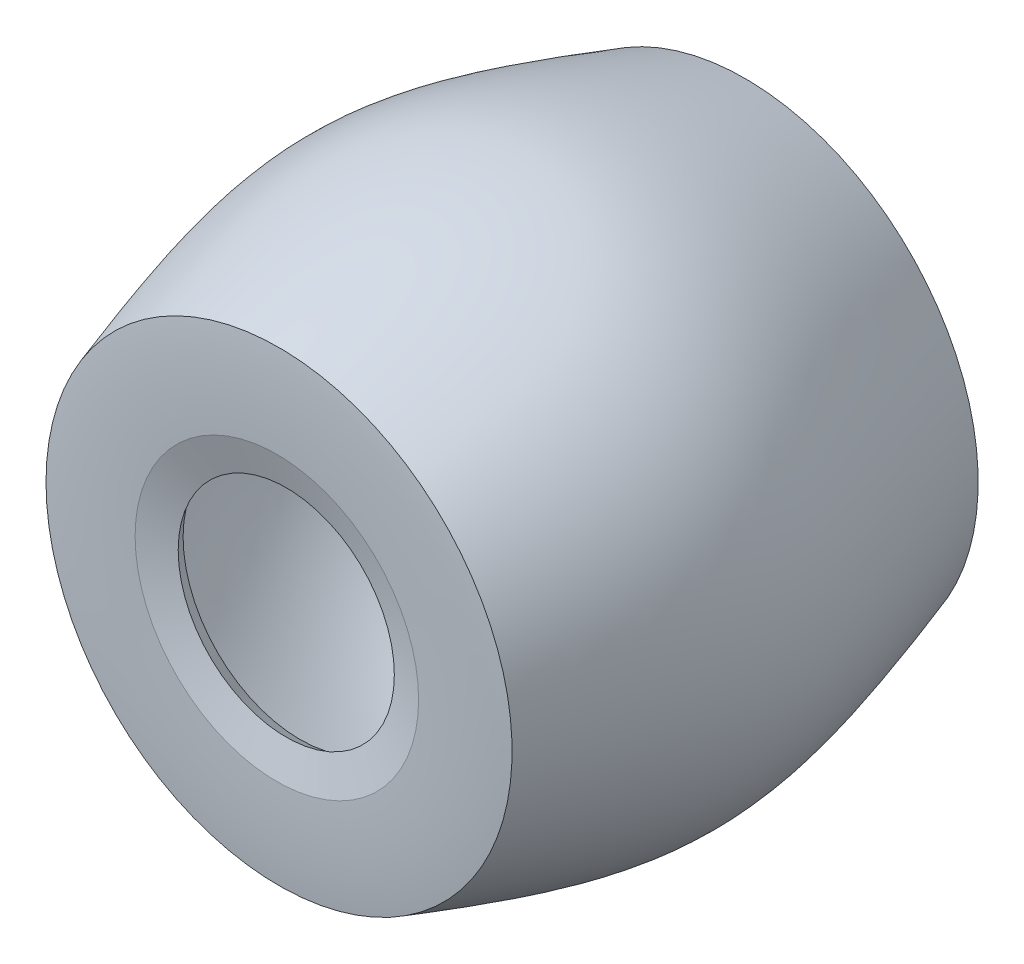
ISO-10303-21;
HEADER;
FILE_DESCRIPTION(('STEP AP214'),'2;1');
FILE_NAME('part.step','',(''),(''),'','','');
FILE_SCHEMA(('AUTOMOTIVE_DESIGN { 1 0 10303 214 1 1 1 1 }'));
ENDSEC;
DATA;
#1=APPLICATION_CONTEXT('core data for automotive mechanical design processes');
#2=APPLICATION_PROTOCOL_DEFINITION('international standard','automotive_design',2000,#1);
#3=PRODUCT_CONTEXT('',#1,'mechanical');
#4=PRODUCT('Part','Part','',(#3));
#5=PRODUCT_RELATED_PRODUCT_CATEGORY('part','',(#4));
#6=PRODUCT_DEFINITION_FORMATION('','',#4);
#7=PRODUCT_DEFINITION_CONTEXT('part definition',#1,'design');
#8=PRODUCT_DEFINITION('design','',#6,#7);
#9=PRODUCT_DEFINITION_SHAPE('','',#8);
#10=(LENGTH_UNIT() NAMED_UNIT(*) SI_UNIT(.MILLI.,.METRE.));
#11=(NAMED_UNIT(*) PLANE_ANGLE_UNIT() SI_UNIT($,.RADIAN.));
#12=(NAMED_UNIT(*) SI_UNIT($,.STERADIAN.) SOLID_ANGLE_UNIT());
#13=UNCERTAINTY_MEASURE_WITH_UNIT(LENGTH_MEASURE(1.E-05),#10,'distance_accuracy_value','');
#14=(GEOMETRIC_REPRESENTATION_CONTEXT(3) GLOBAL_UNCERTAINTY_ASSIGNED_CONTEXT((#13)) GLOBAL_UNIT_ASSIGNED_CONTEXT((#10,
#11,#12)) REPRESENTATION_CONTEXT('',''));
#15=CARTESIAN_POINT('',(0.,0.,0.));
#16=DIRECTION('',(0.,0.,1.));
#17=DIRECTION('',(1.,0.,0.));
#18=AXIS2_PLACEMENT_3D('',#15,#16,#17);
#19=CARTESIAN_POINT('',(0.,0.,-50.4700775616188));
#20=DIRECTION('',(0.,0.,-1.));
#21=DIRECTION('',(-1.,0.,0.));
#22=AXIS2_PLACEMENT_3D('',#19,#20,#21);
#23=CONICAL_SURFACE('',#22,30.411993883509,1.29810152115632);
#24=CARTESIAN_POINT('',(0.,0.,-48.4497629953482));
#25=DIRECTION('',(0.,0.,-1.));
#26=DIRECTION('',(-1.,0.,0.));
#27=AXIS2_PLACEMENT_3D('',#24,#25,#26);
#28=CIRCLE('',#27,23.1878518329737);
#29=CARTESIAN_POINT('',(-23.1878518329737,0.,-48.4497629953482));
#30=VERTEX_POINT('',#29);
#31=EDGE_CURVE('E73',#30,#30,#28,.T.);
#32=ORIENTED_EDGE('',*,*,#31,.F.);
#33=EDGE_LOOP('',(#32));
#34=FACE_BOUND('',#33,.T.);
#35=CARTESIAN_POINT('',(0.,0.,-50.4700775616188));
#36=DIRECTION('',(0.,0.,-1.));
#37=DIRECTION('',(-1.,0.,0.));
#38=AXIS2_PLACEMENT_3D('',#35,#36,#37);
#39=CIRCLE('',#38,30.411993883509);
#40=CARTESIAN_POINT('',(-30.411993883509,0.,-50.4700775616188));
#41=VERTEX_POINT('',#40);
#42=EDGE_CURVE('E10',#41,#41,#39,.T.);
#43=ORIENTED_EDGE('',*,*,#42,.T.);
#44=EDGE_LOOP('',(#43));
#45=FACE_BOUND('',#44,.T.);
#46=ADVANCED_FACE('F33',(#34,#45),#23,.F.);
#47=CARTESIAN_POINT('',(0.,30.411993883509,-50.4700775616188));
#48=CARTESIAN_POINT('',(0.,41.5034681451617,-50.8662016423921));
#49=CARTESIAN_POINT('',(0.,50.,-50.));
#50=B_SPLINE_CURVE_WITH_KNOTS('',2,(#47,#48,#49),.UNSPECIFIED.,.F.,.F.,(3,3),(0.,1.),.UNSPECIFIED.);
#51=CARTESIAN_POINT('',(0.,0.,-45.4445539037163));
#52=DIRECTION('',(0.,0.,-1.));
#53=AXIS1_PLACEMENT('',#51,#52);
#54=SURFACE_OF_REVOLUTION('',#50,#53);
#55=CARTESIAN_POINT('',(0.,0.,-50.));
#56=DIRECTION('',(0.,0.,-1.));
#57=DIRECTION('',(-1.,0.,0.));
#58=AXIS2_PLACEMENT_3D('',#55,#56,#57);
#59=CIRCLE('',#58,50.);
#60=CARTESIAN_POINT('',(-50.,0.,-50.));
#61=VERTEX_POINT('',#60);
#62=EDGE_CURVE('E39',#61,#61,#59,.T.);
#63=ORIENTED_EDGE('',*,*,#62,.T.);
#64=EDGE_LOOP('',(#63));
#65=FACE_BOUND('',#64,.T.);
#66=ORIENTED_EDGE('',*,*,#42,.F.);
#67=EDGE_LOOP('',(#66));
#68=FACE_BOUND('',#67,.T.);
#69=ADVANCED_FACE('F117',(#65,#68),#54,.F.);
#70=CARTESIAN_POINT('',(0.,50.,50.));
#71=CARTESIAN_POINT('',(0.,64.7070901785474,4.90257004531169));
#72=CARTESIAN_POINT('',(0.,64.7070866590545,-4.9025700453117));
#73=CARTESIAN_POINT('',(0.,50.,-50.));
#74=B_SPLINE_CURVE_WITH_KNOTS('',3,(#70,#71,#72,#73),.UNSPECIFIED.,.F.,.F.,(4,4),(0.,1.),.UNSPECIFIED.);
#75=CARTESIAN_POINT('',(0.,0.,-45.4445539037163));
#76=DIRECTION('',(0.,0.,-1.));
#77=AXIS1_PLACEMENT('',#75,#76);
#78=SURFACE_OF_REVOLUTION('',#74,#77);
#79=ORIENTED_EDGE('',*,*,#62,.F.);
#80=EDGE_LOOP('',(#79));
#81=FACE_BOUND('',#80,.T.);
#82=CARTESIAN_POINT('',(0.,0.,50.));
#83=DIRECTION('',(0.,0.,-1.));
#84=DIRECTION('',(-1.,0.,0.));
#85=AXIS2_PLACEMENT_3D('',#82,#83,#84);
#86=CIRCLE('',#85,50.);
#87=CARTESIAN_POINT('',(-50.,0.,50.));
#88=VERTEX_POINT('',#87);
#89=EDGE_CURVE('E43',#88,#88,#86,.T.);
#90=ORIENTED_EDGE('',*,*,#89,.T.);
#91=EDGE_LOOP('',(#90));
#92=FACE_BOUND('',#91,.T.);
#93=ADVANCED_FACE('F114',(#81,#92),#78,.T.);
#94=CARTESIAN_POINT('',(0.,30.411993883509,50.4700775616188));
#95=CARTESIAN_POINT('',(0.,41.5034681451617,50.8662016423921));
#96=CARTESIAN_POINT('',(0.,50.,50.));
#97=B_SPLINE_CURVE_WITH_KNOTS('',2,(#94,#95,#96),.UNSPECIFIED.,.F.,.F.,(3,3),(0.,1.),.UNSPECIFIED.);
#98=CARTESIAN_POINT('',(0.,0.,-45.4445539037163));
#99=DIRECTION('',(0.,0.,-1.));
#100=AXIS1_PLACEMENT('',#98,#99);
#101=SURFACE_OF_REVOLUTION('',#97,#100);
#102=ORIENTED_EDGE('',*,*,#89,.F.);
#103=EDGE_LOOP('',(#102));
#104=FACE_BOUND('',#103,.T.);
#105=CARTESIAN_POINT('',(0.,0.,50.4700775616188));
#106=DIRECTION('',(0.,0.,-1.));
#107=DIRECTION('',(-1.,0.,0.));
#108=AXIS2_PLACEMENT_3D('',#105,#106,#107);
#109=CIRCLE('',#108,30.411993883509);
#110=CARTESIAN_POINT('',(-30.411993883509,0.,50.4700775616188));
#111=VERTEX_POINT('',#110);
#112=EDGE_CURVE('E47',#111,#111,#109,.T.);
#113=ORIENTED_EDGE('',*,*,#112,.T.);
#114=EDGE_LOOP('',(#113));
#115=FACE_BOUND('',#114,.T.);
#116=ADVANCED_FACE('F110',(#104,#115),#101,.T.);
#117=CARTESIAN_POINT('',(0.,0.,50.4700775616188));
#118=DIRECTION('',(0.,0.,1.));
#119=DIRECTION('',(1.,0.,0.));
#120=AXIS2_PLACEMENT_3D('',#117,#118,#119);
#121=CONICAL_SURFACE('',#120,30.411993883509,1.29810152115632);
#122=CARTESIAN_POINT('',(0.,0.,48.4497629953482));
#123=DIRECTION('',(0.,0.,-1.));
#124=DIRECTION('',(-1.,0.,0.));
#125=AXIS2_PLACEMENT_3D('',#122,#123,#124);
#126=CIRCLE('',#125,23.1878518329737);
#127=CARTESIAN_POINT('',(-23.1878518329737,0.,48.4497629953482));
#128=VERTEX_POINT('',#127);
#129=EDGE_CURVE('E52',#128,#128,#126,.T.);
#130=ORIENTED_EDGE('',*,*,#129,.T.);
#131=EDGE_LOOP('',(#130));
#132=FACE_BOUND('',#131,.T.);
#133=ORIENTED_EDGE('',*,*,#112,.F.);
#134=EDGE_LOOP('',(#133));
#135=FACE_BOUND('',#134,.T.);
#136=ADVANCED_FACE('F106',(#132,#135),#121,.F.);
#137=CARTESIAN_POINT('',(0.,0.,48.4497629953482));
#138=DIRECTION('',(0.,0.,-1.));
#139=DIRECTION('',(-1.,0.,0.));
#140=AXIS2_PLACEMENT_3D('',#137,#138,#139);
#141=CONICAL_SURFACE('',#140,23.1878518329737,0.573300829062741);
#142=CARTESIAN_POINT('',(0.,0.,45.4858641402746));
#143=DIRECTION('',(0.,0.,-1.));
#144=DIRECTION('',(-1.,0.,0.));
#145=AXIS2_PLACEMENT_3D('',#142,#143,#144);
#146=CIRCLE('',#145,25.1014498153562);
#147=CARTESIAN_POINT('',(-25.1014498153562,0.,45.4858641402746));
#148=VERTEX_POINT('',#147);
#149=EDGE_CURVE('E55',#148,#148,#146,.T.);
#150=ORIENTED_EDGE('',*,*,#149,.T.);
#151=EDGE_LOOP('',(#150));
#152=FACE_BOUND('',#151,.T.);
#153=ORIENTED_EDGE('',*,*,#129,.F.);
#154=EDGE_LOOP('',(#153));
#155=FACE_BOUND('',#154,.T.);
#156=ADVANCED_FACE('F102',(#152,#155),#141,.F.);
#157=CARTESIAN_POINT('',(0.,0.,48.4497629953482));
#158=DIRECTION('',(0.,0.,1.));
#159=DIRECTION('',(1.,0.,0.));
#160=AXIS2_PLACEMENT_3D('',#157,#158,#159);
#161=CONICAL_SURFACE('',#160,29.9874222046651,1.02552783841316);
#162=ORIENTED_EDGE('',*,*,#149,.F.);
#163=EDGE_LOOP('',(#162));
#164=FACE_BOUND('',#163,.T.);
#165=CARTESIAN_POINT('',(0.,0.,48.4497629953482));
#166=DIRECTION('',(0.,0.,-1.));
#167=DIRECTION('',(-1.,0.,0.));
#168=AXIS2_PLACEMENT_3D('',#165,#166,#167);
#169=CIRCLE('',#168,29.9874222046651);
#170=CARTESIAN_POINT('',(-29.9874222046651,0.,48.4497629953482));
#171=VERTEX_POINT('',#170);
#172=EDGE_CURVE('E58',#171,#171,#169,.T.);
#173=ORIENTED_EDGE('',*,*,#172,.T.);
#174=EDGE_LOOP('',(#173));
#175=FACE_BOUND('',#174,.T.);
#176=ADVANCED_FACE('F98',(#164,#175),#161,.T.);
#177=CARTESIAN_POINT('',(0.,2.2032136800595E-13,48.4497629953481));
#178=DIRECTION('',(0.,0.,1.));
#179=DIRECTION('',(1.,0.,0.));
#180=AXIS2_PLACEMENT_3D('',#177,#178,#179);
#181=PLANE('',#180);
#182=ORIENTED_EDGE('',*,*,#172,.F.);
#183=EDGE_LOOP('',(#182));
#184=FACE_BOUND('',#183,.T.);
#185=CARTESIAN_POINT('',(0.,0.,48.4497629953481));
#186=DIRECTION('',(0.,0.,-1.));
#187=DIRECTION('',(-1.,0.,0.));
#188=AXIS2_PLACEMENT_3D('',#185,#186,#187);
#189=CIRCLE('',#188,45.2463945021271);
#190=CARTESIAN_POINT('',(-45.2463945021271,0.,48.4497629953481));
#191=VERTEX_POINT('',#190);
#192=EDGE_CURVE('E61',#191,#191,#189,.T.);
#193=ORIENTED_EDGE('',*,*,#192,.T.);
#194=EDGE_LOOP('',(#193));
#195=FACE_BOUND('',#194,.T.);
#196=ADVANCED_FACE('F93',(#184,#195),#181,.F.);
#197=CARTESIAN_POINT('',(0.,45.2463945021271,48.4497629953481));
#198=CARTESIAN_POINT('',(0.,45.4722135081543,47.7573176045118));
#199=CARTESIAN_POINT('',(0.,45.9266727673383,46.3590094197082));
#200=CARTESIAN_POINT('',(0.,46.7955377612236,43.6640407444149));
#201=CARTESIAN_POINT('',(0.,47.8300946423352,40.4096940642179));
#202=CARTESIAN_POINT('',(0.,48.9815789896713,36.6981466107603));
#203=CARTESIAN_POINT('',(0.,50.3994560972387,31.9835620129376));
#204=CARTESIAN_POINT('',(0.,51.9503560488493,26.5031270377789));
#205=CARTESIAN_POINT('',(0.,53.4588870964072,20.4895176856162));
#206=CARTESIAN_POINT('',(0.,54.6189037196693,14.940594208713));
#207=CARTESIAN_POINT('',(0.,55.709950303496,8.02223724105753));
#208=CARTESIAN_POINT('',(0.,56.2438938262732,1.74721384495896E-07));
#209=CARTESIAN_POINT('',(0.,55.7099497881879,-8.02223696391747));
#210=CARTESIAN_POINT('',(0.,54.6189028855995,-14.9405940446585));
#211=CARTESIAN_POINT('',(0.,53.4588861024265,-20.4895176208684));
#212=CARTESIAN_POINT('',(0.,51.9503550081349,-26.503127077628));
#213=CARTESIAN_POINT('',(0.,50.3994551414153,-31.9835621391686));
#214=CARTESIAN_POINT('',(0.,48.9815781935082,-36.6981468039352));
#215=CARTESIAN_POINT('',(0.,47.8300940158837,-40.4096943064103));
#216=CARTESIAN_POINT('',(0.,46.7955373218436,-43.6640410259563));
#217=CARTESIAN_POINT('',(0.,45.9266725059043,-46.3590097326142));
#218=CARTESIAN_POINT('',(0.,45.4722133474308,-47.7573179316437));
#219=CARTESIAN_POINT('',(0.,45.2463943927736,-48.4497633306667));
#220=B_SPLINE_CURVE_WITH_KNOTS('',3,(#197,#198,#199,#200,#201,#202,#203,#204,#205,#206,#207,
#208,#209,#210,#211,#212,#213,#214,#215,#216,#217,#218,#219),.UNSPECIFIED.,.F.,.F.,(4,1,1,1,1,1,
1,1,1,1,1,1,1,1,1,1,1,1,1,1,4),(0.,0.015625,0.03125,0.0625,0.09375,0.125,0.1875,0.25,0.3125,
0.375,0.5,0.625,0.6875,0.75,0.8125,0.875,0.90625,0.9375,0.96875,0.984375,1.),.UNSPECIFIED.);
#221=CARTESIAN_POINT('',(0.,0.,-45.4445539037163));
#222=DIRECTION('',(0.,0.,-1.));
#223=AXIS1_PLACEMENT('',#221,#222);
#224=SURFACE_OF_REVOLUTION('',#220,#223);
#225=CARTESIAN_POINT('',(0.,0.,-48.4497633306667));
#226=DIRECTION('',(0.,0.,-1.));
#227=DIRECTION('',(-1.,0.,0.));
#228=AXIS2_PLACEMENT_3D('',#225,#226,#227);
#229=CIRCLE('',#228,45.2463943927736);
#230=CARTESIAN_POINT('',(-45.2463943927736,0.,-48.4497633306667));
#231=VERTEX_POINT('',#230);
#232=EDGE_CURVE('E64',#231,#231,#229,.T.);
#233=ORIENTED_EDGE('',*,*,#232,.T.);
#234=EDGE_LOOP('',(#233));
#235=FACE_BOUND('',#234,.T.);
#236=ORIENTED_EDGE('',*,*,#192,.F.);
#237=EDGE_LOOP('',(#236));
#238=FACE_BOUND('',#237,.T.);
#239=ADVANCED_FACE('F88',(#235,#238),#224,.F.);
#240=CARTESIAN_POINT('',(0.,-1.06469201000143E-06,-48.4497631630074));
#241=DIRECTION('',(0.,0.,1.));
#242=DIRECTION('',(1.,0.,0.));
#243=AXIS2_PLACEMENT_3D('',#240,#241,#242);
#244=PLANE('',#243);
#245=CARTESIAN_POINT('',(0.,0.,-48.4497629953482));
#246=DIRECTION('',(0.,0.,-1.));
#247=DIRECTION('',(-1.,0.,0.));
#248=AXIS2_PLACEMENT_3D('',#245,#246,#247);
#249=CIRCLE('',#248,29.9874222046651);
#250=CARTESIAN_POINT('',(-29.9874222046651,0.,-48.4497629953482));
#251=VERTEX_POINT('',#250);
#252=EDGE_CURVE('E67',#251,#251,#249,.T.);
#253=ORIENTED_EDGE('',*,*,#252,.T.);
#254=EDGE_LOOP('',(#253));
#255=FACE_BOUND('',#254,.T.);
#256=ORIENTED_EDGE('',*,*,#232,.F.);
#257=EDGE_LOOP('',(#256));
#258=FACE_BOUND('',#257,.T.);
#259=ADVANCED_FACE('F92',(#255,#258),#244,.T.);
#260=CARTESIAN_POINT('',(0.,0.,-48.4497629953482));
#261=DIRECTION('',(0.,0.,-1.));
#262=DIRECTION('',(-1.,0.,0.));
#263=AXIS2_PLACEMENT_3D('',#260,#261,#262);
#264=CONICAL_SURFACE('',#263,29.9874222046651,1.02552783841316);
#265=CARTESIAN_POINT('',(0.,0.,-45.4858641402745));
#266=DIRECTION('',(0.,0.,-1.));
#267=DIRECTION('',(-1.,0.,0.));
#268=AXIS2_PLACEMENT_3D('',#265,#266,#267);
#269=CIRCLE('',#268,25.1014498153562);
#270=CARTESIAN_POINT('',(-25.1014498153562,0.,-45.4858641402745));
#271=VERTEX_POINT('',#270);
#272=EDGE_CURVE('E70',#271,#271,#269,.T.);
#273=ORIENTED_EDGE('',*,*,#272,.T.);
#274=EDGE_LOOP('',(#273));
#275=FACE_BOUND('',#274,.T.);
#276=ORIENTED_EDGE('',*,*,#252,.F.);
#277=EDGE_LOOP('',(#276));
#278=FACE_BOUND('',#277,.T.);
#279=ADVANCED_FACE('F144',(#275,#278),#264,.T.);
#280=CARTESIAN_POINT('',(0.,0.,-48.4497629953482));
#281=DIRECTION('',(0.,0.,1.));
#282=DIRECTION('',(1.,0.,0.));
#283=AXIS2_PLACEMENT_3D('',#280,#281,#282);
#284=CONICAL_SURFACE('',#283,23.1878518329737,0.573300829062745);
#285=ORIENTED_EDGE('',*,*,#272,.F.);
#286=EDGE_LOOP('',(#285));
#287=FACE_BOUND('',#286,.T.);
#288=ORIENTED_EDGE('',*,*,#31,.T.);
#289=EDGE_LOOP('',(#288));
#290=FACE_BOUND('',#289,.T.);
#291=ADVANCED_FACE('F142',(#287,#290),#284,.F.);
#292=CLOSED_SHELL('',(#46,#69,#93,#116,#136,#156,#176,#196,#239,#259,#279,#291));
#293=MANIFOLD_SOLID_BREP('B2',#292);
#294=ADVANCED_BREP_SHAPE_REPRESENTATION('',(#18,#293),#14);
#295=SHAPE_DEFINITION_REPRESENTATION(#9,#294);
ENDSEC;
END-ISO-10303-21;
